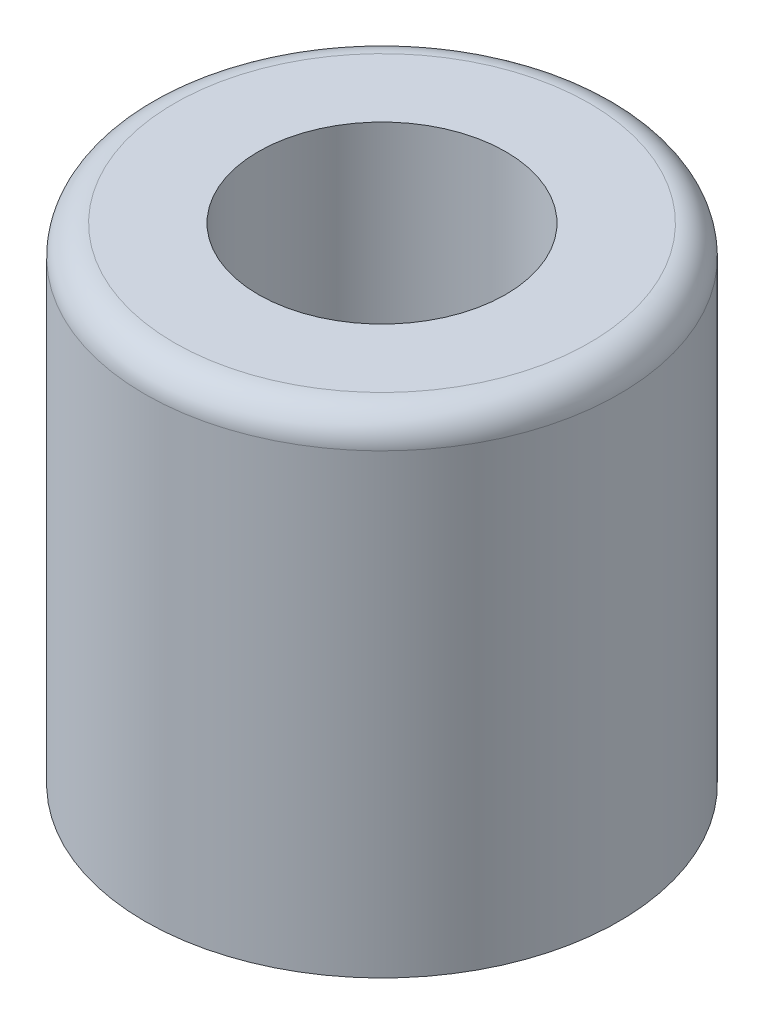
ISO-10303-21;
HEADER;
FILE_DESCRIPTION(('STEP AP214'),'2;1');
FILE_NAME('part.step','',(''),(''),'','','');
FILE_SCHEMA(('AUTOMOTIVE_DESIGN { 1 0 10303 214 1 1 1 1 }'));
ENDSEC;
DATA;
#1=APPLICATION_CONTEXT('core data for automotive mechanical design processes');
#2=APPLICATION_PROTOCOL_DEFINITION('international standard','automotive_design',2000,#1);
#3=PRODUCT_CONTEXT('',#1,'mechanical');
#4=PRODUCT('Part','Part','',(#3));
#5=PRODUCT_RELATED_PRODUCT_CATEGORY('part','',(#4));
#6=PRODUCT_DEFINITION_FORMATION('','',#4);
#7=PRODUCT_DEFINITION_CONTEXT('part definition',#1,'design');
#8=PRODUCT_DEFINITION('design','',#6,#7);
#9=PRODUCT_DEFINITION_SHAPE('','',#8);
#10=(LENGTH_UNIT() NAMED_UNIT(*) SI_UNIT(.MILLI.,.METRE.));
#11=(NAMED_UNIT(*) PLANE_ANGLE_UNIT() SI_UNIT($,.RADIAN.));
#12=(NAMED_UNIT(*) SI_UNIT($,.STERADIAN.) SOLID_ANGLE_UNIT());
#13=UNCERTAINTY_MEASURE_WITH_UNIT(LENGTH_MEASURE(1.E-05),#10,'distance_accuracy_value','');
#14=(GEOMETRIC_REPRESENTATION_CONTEXT(3) GLOBAL_UNCERTAINTY_ASSIGNED_CONTEXT((#13)) GLOBAL_UNIT_ASSIGNED_CONTEXT((#10,
#11,#12)) REPRESENTATION_CONTEXT('',''));
#15=CARTESIAN_POINT('',(0.,0.,0.));
#16=DIRECTION('',(0.,0.,1.));
#17=DIRECTION('',(1.,0.,0.));
#18=AXIS2_PLACEMENT_3D('',#15,#16,#17);
#19=CARTESIAN_POINT('',(0.,4.1656,0.));
#20=DIRECTION('',(0.,1.,0.));
#21=DIRECTION('',(0.,0.,1.));
#22=AXIS2_PLACEMENT_3D('',#19,#20,#21);
#23=PLANE('',#22);
#24=CARTESIAN_POINT('',(0.,4.1656,0.));
#25=DIRECTION('',(0.,-1.,0.));
#26=DIRECTION('',(0.,0.,-1.));
#27=AXIS2_PLACEMENT_3D('',#24,#25,#26);
#28=CIRCLE('',#27,2.1209);
#29=CARTESIAN_POINT('',(0.,4.1656,-2.1209));
#30=VERTEX_POINT('',#29);
#31=EDGE_CURVE('E40',#30,#30,#28,.T.);
#32=ORIENTED_EDGE('',*,*,#31,.T.);
#33=EDGE_LOOP('',(#32));
#34=FACE_BOUND('',#33,.T.);
#35=CARTESIAN_POINT('',(0.,4.1656,0.));
#36=DIRECTION('',(0.,-1.,0.));
#37=DIRECTION('',(0.,0.,-1.));
#38=AXIS2_PLACEMENT_3D('',#35,#36,#37);
#39=CIRCLE('',#38,3.556);
#40=CARTESIAN_POINT('',(0.,4.1656,-3.556));
#41=VERTEX_POINT('',#40);
#42=CARTESIAN_POINT('',(0.,4.1656,3.556));
#43=VERTEX_POINT('',#42);
#44=EDGE_CURVE('E34',#41,#43,#39,.T.);
#45=ORIENTED_EDGE('',*,*,#44,.F.);
#46=CARTESIAN_POINT('',(0.,4.1656,0.));
#47=DIRECTION('',(0.,-1.,0.));
#48=DIRECTION('',(0.,0.,1.));
#49=AXIS2_PLACEMENT_3D('',#46,#47,#48);
#50=CIRCLE('',#49,3.556);
#51=EDGE_CURVE('E38',#43,#41,#50,.T.);
#52=ORIENTED_EDGE('',*,*,#51,.F.);
#53=EDGE_LOOP('',(#45,#52));
#54=FACE_BOUND('',#53,.T.);
#55=ADVANCED_FACE('F16',(#34,#54),#23,.T.);
#56=CARTESIAN_POINT('',(0.,4.1656,0.));
#57=DIRECTION('',(0.,-1.,0.));
#58=DIRECTION('',(0.,0.,-1.));
#59=AXIS2_PLACEMENT_3D('',#56,#57,#58);
#60=CYLINDRICAL_SURFACE('',#59,2.1209);
#61=CARTESIAN_POINT('',(0.,-4.1656,0.));
#62=DIRECTION('',(0.,-1.,0.));
#63=DIRECTION('',(0.,0.,-1.));
#64=AXIS2_PLACEMENT_3D('',#61,#62,#63);
#65=CIRCLE('',#64,2.1209);
#66=CARTESIAN_POINT('',(0.,-4.1656,-2.1209));
#67=VERTEX_POINT('',#66);
#68=EDGE_CURVE('E45',#67,#67,#65,.T.);
#69=ORIENTED_EDGE('',*,*,#68,.T.);
#70=EDGE_LOOP('',(#69));
#71=FACE_BOUND('',#70,.T.);
#72=ORIENTED_EDGE('',*,*,#31,.F.);
#73=EDGE_LOOP('',(#72));
#74=FACE_BOUND('',#73,.T.);
#75=ADVANCED_FACE('F62',(#71,#74),#60,.F.);
#76=CARTESIAN_POINT('',(0.,3.6576,0.));
#77=DIRECTION('',(0.,1.,0.));
#78=DIRECTION('',(0.,0.,1.));
#79=AXIS2_PLACEMENT_3D('',#76,#77,#78);
#80=TOROIDAL_SURFACE('',#79,3.556,0.508);
#81=CARTESIAN_POINT('',(0.,3.6576,0.));
#82=DIRECTION('',(0.,-1.,0.));
#83=DIRECTION('',(0.,0.,-1.));
#84=AXIS2_PLACEMENT_3D('',#81,#82,#83);
#85=CIRCLE('',#84,4.064);
#86=CARTESIAN_POINT('',(0.,3.6576,-4.064));
#87=VERTEX_POINT('',#86);
#88=EDGE_CURVE('E28',#87,#87,#85,.T.);
#89=ORIENTED_EDGE('',*,*,#88,.F.);
#90=EDGE_LOOP('',(#89));
#91=FACE_BOUND('',#90,.T.);
#92=ORIENTED_EDGE('',*,*,#51,.T.);
#93=ORIENTED_EDGE('',*,*,#44,.T.);
#94=EDGE_LOOP('',(#92,#93));
#95=FACE_BOUND('',#94,.T.);
#96=ADVANCED_FACE('F44',(#91,#95),#80,.T.);
#97=CARTESIAN_POINT('',(0.,-4.1656,0.));
#98=DIRECTION('',(0.,1.,0.));
#99=DIRECTION('',(0.,0.,1.));
#100=AXIS2_PLACEMENT_3D('',#97,#98,#99);
#101=PLANE('',#100);
#102=ORIENTED_EDGE('',*,*,#68,.F.);
#103=EDGE_LOOP('',(#102));
#104=FACE_BOUND('',#103,.T.);
#105=CARTESIAN_POINT('',(0.,-4.1656,0.));
#106=DIRECTION('',(0.,-1.,0.));
#107=DIRECTION('',(0.,0.,-1.));
#108=AXIS2_PLACEMENT_3D('',#105,#106,#107);
#109=CIRCLE('',#108,4.064);
#110=CARTESIAN_POINT('',(0.,-4.1656,-4.064));
#111=VERTEX_POINT('',#110);
#112=EDGE_CURVE('E11',#111,#111,#109,.F.);
#113=ORIENTED_EDGE('',*,*,#112,.F.);
#114=EDGE_LOOP('',(#113));
#115=FACE_BOUND('',#114,.T.);
#116=ADVANCED_FACE('F61',(#104,#115),#101,.F.);
#117=CARTESIAN_POINT('',(0.,4.1656,0.));
#118=DIRECTION('',(0.,-1.,0.));
#119=DIRECTION('',(0.,0.,-1.));
#120=AXIS2_PLACEMENT_3D('',#117,#118,#119);
#121=CYLINDRICAL_SURFACE('',#120,4.064);
#122=ORIENTED_EDGE('',*,*,#88,.T.);
#123=EDGE_LOOP('',(#122));
#124=FACE_BOUND('',#123,.T.);
#125=ORIENTED_EDGE('',*,*,#112,.T.);
#126=EDGE_LOOP('',(#125));
#127=FACE_BOUND('',#126,.T.);
#128=ADVANCED_FACE('F84',(#124,#127),#121,.T.);
#129=CLOSED_SHELL('',(#55,#75,#96,#116,#128));
#130=MANIFOLD_SOLID_BREP('B1',#129);
#131=ADVANCED_BREP_SHAPE_REPRESENTATION('',(#18,#130),#14);
#132=SHAPE_DEFINITION_REPRESENTATION(#9,#131);
ENDSEC;
END-ISO-10303-21;
